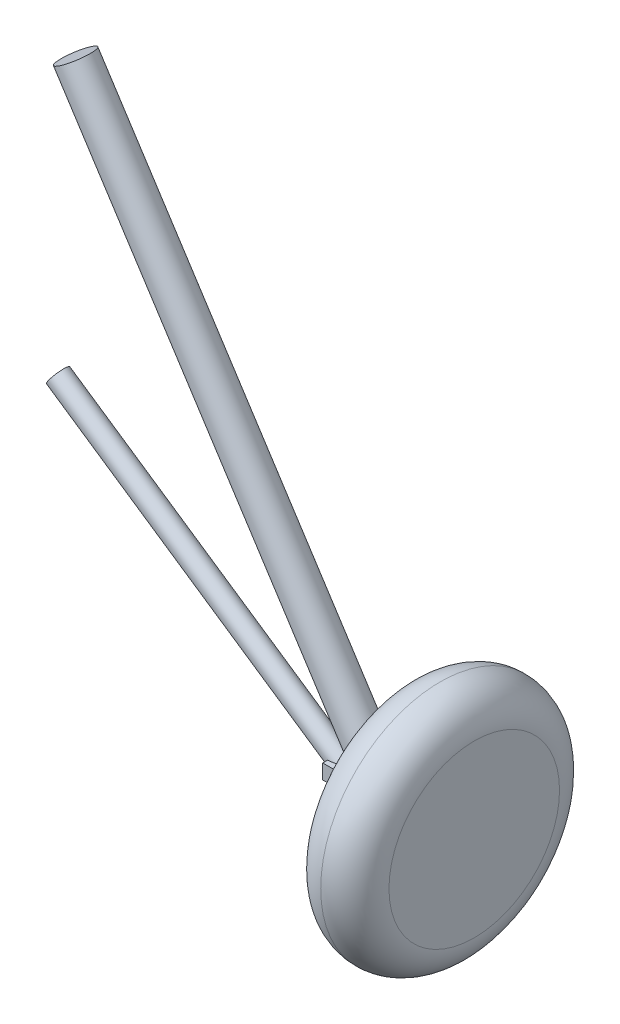
ISO-10303-21;
HEADER;
FILE_DESCRIPTION(('STEP AP214'),'2;1');
FILE_NAME('part.step','',(''),(''),'','','');
FILE_SCHEMA(('AUTOMOTIVE_DESIGN { 1 0 10303 214 1 1 1 1 }'));
ENDSEC;
DATA;
#1=APPLICATION_CONTEXT('core data for automotive mechanical design processes');
#2=APPLICATION_PROTOCOL_DEFINITION('international standard','automotive_design',2000,#1);
#3=PRODUCT_CONTEXT('',#1,'mechanical');
#4=PRODUCT('Part','Part','',(#3));
#5=PRODUCT_RELATED_PRODUCT_CATEGORY('part','',(#4));
#6=PRODUCT_DEFINITION_FORMATION('','',#4);
#7=PRODUCT_DEFINITION_CONTEXT('part definition',#1,'design');
#8=PRODUCT_DEFINITION('design','',#6,#7);
#9=PRODUCT_DEFINITION_SHAPE('','',#8);
#10=(LENGTH_UNIT() NAMED_UNIT(*) SI_UNIT(.MILLI.,.METRE.));
#11=(NAMED_UNIT(*) PLANE_ANGLE_UNIT() SI_UNIT($,.RADIAN.));
#12=(NAMED_UNIT(*) SI_UNIT($,.STERADIAN.) SOLID_ANGLE_UNIT());
#13=UNCERTAINTY_MEASURE_WITH_UNIT(LENGTH_MEASURE(1.E-05),#10,'distance_accuracy_value','');
#14=(GEOMETRIC_REPRESENTATION_CONTEXT(3) GLOBAL_UNCERTAINTY_ASSIGNED_CONTEXT((#13)) GLOBAL_UNIT_ASSIGNED_CONTEXT((#10,
#11,#12)) REPRESENTATION_CONTEXT('',''));
#15=CARTESIAN_POINT('',(0.,0.,0.));
#16=DIRECTION('',(0.,0.,1.));
#17=DIRECTION('',(1.,0.,0.));
#18=AXIS2_PLACEMENT_3D('',#15,#16,#17);
#19=CARTESIAN_POINT('',(-3.,0.162074381040965,-0.423194217162501));
#20=DIRECTION('',(0.,-1.,0.));
#21=DIRECTION('',(0.,0.,-1.));
#22=AXIS2_PLACEMENT_3D('',#19,#20,#21);
#23=PLANE('',#22);
#24=DIRECTION('',(0.,0.,-1.));
#25=VECTOR('',#24,1.);
#26=CARTESIAN_POINT('',(-2.70065203099796,0.162074381040965,-0.423194217162501));
#27=LINE('',#26,#25);
#28=CARTESIAN_POINT('',(-2.70065203099796,0.162074381040965,0.227293758419867));
#29=VERTEX_POINT('',#28);
#30=CARTESIAN_POINT('',(-2.70065203099796,0.162074381040965,-0.227293758419867));
#31=VERTEX_POINT('',#30);
#32=EDGE_CURVE('E11',#29,#31,#27,.T.);
#33=ORIENTED_EDGE('',*,*,#32,.F.);
#34=CARTESIAN_POINT('',(-3.04961610836401,0.162074381040965,0.));
#35=DIRECTION('',(0.,-1.,0.));
#36=DIRECTION('',(1.,0.,0.));
#37=AXIS2_PLACEMENT_3D('',#34,#35,#36);
#38=ELLIPSE('',#37,0.534674921679859,0.3);
#39=CARTESIAN_POINT('',(-3.,0.162074381040965,0.298705520991415));
#40=VERTEX_POINT('',#39);
#41=EDGE_CURVE('E131',#29,#40,#38,.T.);
#42=ORIENTED_EDGE('',*,*,#41,.T.);
#43=DIRECTION('',(0.,0.,-1.));
#44=VECTOR('',#43,1.);
#45=CARTESIAN_POINT('',(-3.,0.162074381040965,-0.423194217162501));
#46=LINE('',#45,#44);
#47=CARTESIAN_POINT('',(-3.,0.162074381040965,0.441202481722608));
#48=VERTEX_POINT('',#47);
#49=EDGE_CURVE('E121',#48,#40,#46,.T.);
#50=ORIENTED_EDGE('',*,*,#49,.F.);
#51=DIRECTION('',(1.,0.,0.));
#52=VECTOR('',#51,1.);
#53=CARTESIAN_POINT('',(-3.,0.162074381040965,0.441202481722608));
#54=LINE('',#53,#52);
#55=CARTESIAN_POINT('',(-1.99949547273326,0.162074381040965,0.441202481722608));
#56=VERTEX_POINT('',#55);
#57=EDGE_CURVE('E161',#48,#56,#54,.T.);
#58=ORIENTED_EDGE('',*,*,#57,.T.);
#59=CARTESIAN_POINT('',(-1.71943990638096,0.162074381040965,0.));
#60=DIRECTION('',(0.,-1.,0.));
#61=DIRECTION('',(1.,0.,0.));
#62=AXIS2_PLACEMENT_3D('',#59,#60,#61);
#63=ELLIPSE('',#62,0.595241474332954,0.500000000000001);
#64=CARTESIAN_POINT('',(-2.0364453186906,0.162074381040965,-0.423194217162501));
#65=VERTEX_POINT('',#64);
#66=EDGE_CURVE('E138',#56,#65,#63,.T.);
#67=ORIENTED_EDGE('',*,*,#66,.T.);
#68=DIRECTION('',(1.,0.,0.));
#69=VECTOR('',#68,1.);
#70=CARTESIAN_POINT('',(-3.,0.162074381040965,-0.423194217162501));
#71=LINE('',#70,#69);
#72=CARTESIAN_POINT('',(-3.,0.162074381040965,-0.423194217162501));
#73=VERTEX_POINT('',#72);
#74=EDGE_CURVE('E164',#73,#65,#71,.T.);
#75=ORIENTED_EDGE('',*,*,#74,.F.);
#76=CARTESIAN_POINT('',(-3.,0.162074381040965,-0.298705520991416));
#77=VERTEX_POINT('',#76);
#78=EDGE_CURVE('E129',#77,#73,#46,.T.);
#79=ORIENTED_EDGE('',*,*,#78,.F.);
#80=EDGE_CURVE('E50',#77,#31,#38,.T.);
#81=ORIENTED_EDGE('',*,*,#80,.T.);
#82=EDGE_LOOP('',(#33,#42,#50,#58,#67,#75,#79,#81));
#83=FACE_BOUND('',#82,.T.);
#84=ADVANCED_FACE('F35',(#83),#23,.F.);
#85=CARTESIAN_POINT('',(-1.,0.,0.));
#86=DIRECTION('',(1.,0.,0.));
#87=DIRECTION('',(0.,0.,-1.));
#88=AXIS2_PLACEMENT_3D('',#85,#86,#87);
#89=PLANE('',#88);
#90=CARTESIAN_POINT('',(-1.,0.,0.));
#91=DIRECTION('',(1.,0.,0.));
#92=DIRECTION('',(0.,0.,-1.));
#93=AXIS2_PLACEMENT_3D('',#90,#91,#92);
#94=CIRCLE('',#93,2.5);
#95=CARTESIAN_POINT('',(-1.,0.,-2.5));
#96=VERTEX_POINT('',#95);
#97=EDGE_CURVE('E146',#96,#96,#94,.F.);
#98=ORIENTED_EDGE('',*,*,#97,.T.);
#99=EDGE_LOOP('',(#98));
#100=FACE_BOUND('',#99,.T.);
#101=DIRECTION('',(0.,-1.,0.));
#102=VECTOR('',#101,1.);
#103=CARTESIAN_POINT('',(-1.,0.162074381040965,-0.423194217162501));
#104=LINE('',#103,#102);
#105=CARTESIAN_POINT('',(-1.,0.162074381040965,-0.423194217162501));
#106=VERTEX_POINT('',#105);
#107=CARTESIAN_POINT('',(-1.,-0.270123968401589,-0.423194217162501));
#108=VERTEX_POINT('',#107);
#109=EDGE_CURVE('E177',#106,#108,#104,.T.);
#110=ORIENTED_EDGE('',*,*,#109,.F.);
#111=DIRECTION('',(0.,0.,-1.));
#112=VECTOR('',#111,1.);
#113=CARTESIAN_POINT('',(-1.,0.162074381040965,-0.423194217162501));
#114=LINE('',#113,#112);
#115=CARTESIAN_POINT('',(-1.,0.162074381040965,0.441202481722608));
#116=VERTEX_POINT('',#115);
#117=EDGE_CURVE('E167',#116,#106,#114,.T.);
#118=ORIENTED_EDGE('',*,*,#117,.F.);
#119=DIRECTION('',(0.,1.,0.));
#120=VECTOR('',#119,1.);
#121=CARTESIAN_POINT('',(-1.,0.162074381040965,0.441202481722608));
#122=LINE('',#121,#120);
#123=CARTESIAN_POINT('',(-1.,-0.270123968401589,0.441202481722608));
#124=VERTEX_POINT('',#123);
#125=EDGE_CURVE('E171',#124,#116,#122,.T.);
#126=ORIENTED_EDGE('',*,*,#125,.F.);
#127=DIRECTION('',(0.,0.,1.));
#128=VECTOR('',#127,1.);
#129=CARTESIAN_POINT('',(-1.,-0.270123968401589,-0.423194217162501));
#130=LINE('',#129,#128);
#131=EDGE_CURVE('E174',#108,#124,#130,.T.);
#132=ORIENTED_EDGE('',*,*,#131,.F.);
#133=EDGE_LOOP('',(#110,#118,#126,#132));
#134=FACE_BOUND('',#133,.T.);
#135=ADVANCED_FACE('F228',(#100,#134),#89,.F.);
#136=CARTESIAN_POINT('',(0.,0.,0.));
#137=DIRECTION('',(1.,0.,0.));
#138=DIRECTION('',(0.,0.,-1.));
#139=AXIS2_PLACEMENT_3D('',#136,#137,#138);
#140=TOROIDAL_SURFACE('',#139,2.5,1.);
#141=CARTESIAN_POINT('',(0.,0.,0.));
#142=DIRECTION('',(1.,0.,0.));
#143=DIRECTION('',(0.,0.,-1.));
#144=AXIS2_PLACEMENT_3D('',#141,#142,#143);
#145=CIRCLE('',#144,3.5);
#146=CARTESIAN_POINT('',(0.,0.,-3.5));
#147=VERTEX_POINT('',#146);
#148=EDGE_CURVE('E149',#147,#147,#145,.F.);
#149=ORIENTED_EDGE('',*,*,#148,.T.);
#150=EDGE_LOOP('',(#149));
#151=FACE_BOUND('',#150,.T.);
#152=ORIENTED_EDGE('',*,*,#97,.F.);
#153=EDGE_LOOP('',(#152));
#154=FACE_BOUND('',#153,.T.);
#155=ADVANCED_FACE('F37',(#151,#154),#140,.T.);
#156=CARTESIAN_POINT('',(0.,0.,0.));
#157=DIRECTION('',(1.,0.,0.));
#158=DIRECTION('',(0.,0.,-1.));
#159=AXIS2_PLACEMENT_3D('',#156,#157,#158);
#160=TOROIDAL_SURFACE('',#159,2.5,1.);
#161=CARTESIAN_POINT('',(1.,0.,0.));
#162=DIRECTION('',(1.,0.,0.));
#163=DIRECTION('',(0.,0.,-1.));
#164=AXIS2_PLACEMENT_3D('',#161,#162,#163);
#165=CIRCLE('',#164,2.5);
#166=CARTESIAN_POINT('',(1.,0.,-2.5));
#167=VERTEX_POINT('',#166);
#168=EDGE_CURVE('E152',#167,#167,#165,.T.);
#169=ORIENTED_EDGE('',*,*,#168,.F.);
#170=EDGE_LOOP('',(#169));
#171=FACE_BOUND('',#170,.T.);
#172=ORIENTED_EDGE('',*,*,#148,.F.);
#173=EDGE_LOOP('',(#172));
#174=FACE_BOUND('',#173,.T.);
#175=ADVANCED_FACE('F318',(#171,#174),#160,.T.);
#176=CARTESIAN_POINT('',(1.,0.,0.));
#177=DIRECTION('',(1.,0.,0.));
#178=DIRECTION('',(0.,0.,-1.));
#179=AXIS2_PLACEMENT_3D('',#176,#177,#178);
#180=PLANE('',#179);
#181=ORIENTED_EDGE('',*,*,#168,.T.);
#182=EDGE_LOOP('',(#181));
#183=FACE_BOUND('',#182,.T.);
#184=ADVANCED_FACE('F314',(#183),#180,.T.);
#185=CARTESIAN_POINT('',(-3.,0.162074381040965,-0.423194217162501));
#186=DIRECTION('',(0.,0.,1.));
#187=DIRECTION('',(1.,0.,0.));
#188=AXIS2_PLACEMENT_3D('',#185,#186,#187);
#189=PLANE('',#188);
#190=ORIENTED_EDGE('',*,*,#74,.T.);
#191=DIRECTION('',(0.542593780966882,-0.839995231448407,0.));
#192=VECTOR('',#191,1.);
#193=CARTESIAN_POINT('',(-1.83842465902258,-0.144483518596219,-0.423194217162501));
#194=LINE('',#193,#192);
#195=CARTESIAN_POINT('',(-1.83842465902258,-0.144483518596218,-0.423194217162501));
#196=VERTEX_POINT('',#195);
#197=EDGE_CURVE('E187',#65,#196,#194,.T.);
#198=ORIENTED_EDGE('',*,*,#197,.T.);
#199=DIRECTION('',(-0.839995231448407,-0.542593780966882,0.));
#200=VECTOR('',#199,1.);
#201=CARTESIAN_POINT('',(-2.51830112297925,-0.583648798775908,-0.423194217162501));
#202=LINE('',#201,#200);
#203=CARTESIAN_POINT('',(-1.39107170032319,0.144483518596218,-0.423194217162501));
#204=VERTEX_POINT('',#203);
#205=EDGE_CURVE('E195',#204,#196,#202,.T.);
#206=ORIENTED_EDGE('',*,*,#205,.F.);
#207=DIRECTION('',(0.542593780966882,-0.839995231448407,0.));
#208=VECTOR('',#207,1.);
#209=CARTESIAN_POINT('',(-1.39107170032319,0.144483518596219,-0.423194217162501));
#210=LINE('',#209,#208);
#211=CARTESIAN_POINT('',(-1.40243449407132,0.162074381040965,-0.423194217162501));
#212=VERTEX_POINT('',#211);
#213=EDGE_CURVE('E193',#204,#212,#210,.F.);
#214=ORIENTED_EDGE('',*,*,#213,.T.);
#215=EDGE_CURVE('E128',#212,#106,#71,.T.);
#216=ORIENTED_EDGE('',*,*,#215,.T.);
#217=ORIENTED_EDGE('',*,*,#109,.T.);
#218=DIRECTION('',(1.,0.,0.));
#219=VECTOR('',#218,1.);
#220=CARTESIAN_POINT('',(-3.,-0.270123968401589,-0.423194217162501));
#221=LINE('',#220,#219);
#222=CARTESIAN_POINT('',(-3.,-0.270123968401589,-0.423194217162501));
#223=VERTEX_POINT('',#222);
#224=EDGE_CURVE('E155',#223,#108,#221,.T.);
#225=ORIENTED_EDGE('',*,*,#224,.F.);
#226=DIRECTION('',(0.,-1.,0.));
#227=VECTOR('',#226,1.);
#228=CARTESIAN_POINT('',(-3.,0.162074381040965,-0.423194217162501));
#229=LINE('',#228,#227);
#230=EDGE_CURVE('E170',#73,#223,#229,.T.);
#231=ORIENTED_EDGE('',*,*,#230,.F.);
#232=EDGE_LOOP('',(#190,#198,#206,#214,#216,#217,#225,#231));
#233=FACE_BOUND('',#232,.T.);
#234=ADVANCED_FACE('F298',(#233),#189,.F.);
#235=CARTESIAN_POINT('',(-3.,-0.270123968401589,-0.423194217162501));
#236=DIRECTION('',(0.,1.,0.));
#237=DIRECTION('',(0.,0.,1.));
#238=AXIS2_PLACEMENT_3D('',#235,#236,#237);
#239=PLANE('',#238);
#240=DIRECTION('',(0.,0.,1.));
#241=VECTOR('',#240,1.);
#242=CARTESIAN_POINT('',(-2.03292998218622,-0.270123968401589,-0.423194217162501));
#243=LINE('',#242,#241);
#244=CARTESIAN_POINT('',(-2.03292998218622,-0.270123968401589,-0.0464437481441615));
#245=VERTEX_POINT('',#244);
#246=CARTESIAN_POINT('',(-2.03292998218622,-0.270123968401589,0.0464437481441615));
#247=VERTEX_POINT('',#246);
#248=EDGE_CURVE('E198',#245,#247,#243,.T.);
#249=ORIENTED_EDGE('',*,*,#248,.F.);
#250=CARTESIAN_POINT('',(-1.44026196849277,-0.270123968401589,0.));
#251=DIRECTION('',(0.,1.,0.));
#252=DIRECTION('',(1.,0.,0.));
#253=AXIS2_PLACEMENT_3D('',#250,#251,#252);
#254=ELLIPSE('',#253,0.595241474332954,0.500000000000001);
#255=EDGE_CURVE('E179',#245,#247,#254,.T.);
#256=ORIENTED_EDGE('',*,*,#255,.T.);
#257=EDGE_LOOP('',(#249,#256));
#258=FACE_BOUND('',#257,.T.);
#259=ORIENTED_EDGE('',*,*,#131,.T.);
#260=DIRECTION('',(1.,0.,0.));
#261=VECTOR('',#260,1.);
#262=CARTESIAN_POINT('',(-3.,-0.270123968401589,0.441202481722608));
#263=LINE('',#262,#261);
#264=CARTESIAN_POINT('',(-3.,-0.270123968401589,0.441202481722608));
#265=VERTEX_POINT('',#264);
#266=EDGE_CURVE('E158',#265,#124,#263,.T.);
#267=ORIENTED_EDGE('',*,*,#266,.F.);
#268=DIRECTION('',(0.,0.,1.));
#269=VECTOR('',#268,1.);
#270=CARTESIAN_POINT('',(-3.,-0.270123968401589,-0.423194217162501));
#271=LINE('',#270,#269);
#272=EDGE_CURVE('E182',#223,#265,#271,.T.);
#273=ORIENTED_EDGE('',*,*,#272,.F.);
#274=ORIENTED_EDGE('',*,*,#224,.T.);
#275=EDGE_LOOP('',(#259,#267,#273,#274));
#276=FACE_BOUND('',#275,.T.);
#277=ADVANCED_FACE('F246',(#258,#276),#239,.F.);
#278=CARTESIAN_POINT('',(-3.,0.162074381040965,0.441202481722608));
#279=DIRECTION('',(0.,0.,-1.));
#280=DIRECTION('',(-1.,0.,0.));
#281=AXIS2_PLACEMENT_3D('',#278,#279,#280);
#282=PLANE('',#281);
#283=CARTESIAN_POINT('',(-1.43938434002866,0.162074381040965,0.441202481722608));
#284=VERTEX_POINT('',#283);
#285=EDGE_CURVE('E163',#284,#116,#54,.T.);
#286=ORIENTED_EDGE('',*,*,#285,.F.);
#287=DIRECTION('',(0.542593780966882,-0.839995231448407,0.));
#288=VECTOR('',#287,1.);
#289=CARTESIAN_POINT('',(-1.41714321562016,0.127642658635474,0.441202481722608));
#290=LINE('',#289,#288);
#291=CARTESIAN_POINT('',(-1.41714321562016,0.127642658635473,0.441202481722608));
#292=VERTEX_POINT('',#291);
#293=EDGE_CURVE('E191',#284,#292,#290,.T.);
#294=ORIENTED_EDGE('',*,*,#293,.T.);
#295=DIRECTION('',(0.839995231448407,0.542593780966882,0.));
#296=VECTOR('',#295,1.);
#297=CARTESIAN_POINT('',(-2.51830112297925,-0.583648798775908,0.441202481722608));
#298=LINE('',#297,#296);
#299=CARTESIAN_POINT('',(-1.81235314372561,-0.127642658635473,0.441202481722608));
#300=VERTEX_POINT('',#299);
#301=EDGE_CURVE('E201',#300,#292,#298,.T.);
#302=ORIENTED_EDGE('',*,*,#301,.F.);
#303=DIRECTION('',(0.542593780966882,-0.839995231448407,0.));
#304=VECTOR('',#303,1.);
#305=CARTESIAN_POINT('',(-1.81235314372562,-0.127642658635474,0.441202481722608));
#306=LINE('',#305,#304);
#307=EDGE_CURVE('E189',#300,#56,#306,.F.);
#308=ORIENTED_EDGE('',*,*,#307,.T.);
#309=ORIENTED_EDGE('',*,*,#57,.F.);
#310=DIRECTION('',(0.,1.,0.));
#311=VECTOR('',#310,1.);
#312=CARTESIAN_POINT('',(-3.,0.162074381040965,0.441202481722608));
#313=LINE('',#312,#311);
#314=EDGE_CURVE('E125',#265,#48,#313,.T.);
#315=ORIENTED_EDGE('',*,*,#314,.F.);
#316=ORIENTED_EDGE('',*,*,#266,.T.);
#317=ORIENTED_EDGE('',*,*,#125,.T.);
#318=EDGE_LOOP('',(#286,#294,#302,#308,#309,#315,#316,#317));
#319=FACE_BOUND('',#318,.T.);
#320=ADVANCED_FACE('F239',(#319),#282,.F.);
#321=DIRECTION('',(0.,0.,-1.));
#322=VECTOR('',#321,1.);
#323=CARTESIAN_POINT('',(-1.36383909816487,0.162074381040965,-0.423194217162501));
#324=LINE('',#323,#322);
#325=CARTESIAN_POINT('',(-1.36383909816487,0.162074381040965,0.400969484907506));
#326=VERTEX_POINT('',#325);
#327=CARTESIAN_POINT('',(-1.36383909816487,0.162074381040965,-0.400969484907506));
#328=VERTEX_POINT('',#327);
#329=EDGE_CURVE('E143',#326,#328,#324,.T.);
#330=ORIENTED_EDGE('',*,*,#329,.F.);
#331=EDGE_CURVE('E139',#326,#284,#63,.T.);
#332=ORIENTED_EDGE('',*,*,#331,.T.);
#333=ORIENTED_EDGE('',*,*,#285,.T.);
#334=ORIENTED_EDGE('',*,*,#117,.T.);
#335=ORIENTED_EDGE('',*,*,#215,.F.);
#336=EDGE_CURVE('E141',#212,#328,#63,.T.);
#337=ORIENTED_EDGE('',*,*,#336,.T.);
#338=EDGE_LOOP('',(#330,#332,#333,#334,#335,#337));
#339=FACE_BOUND('',#338,.T.);
#340=ADVANCED_FACE('F230',(#339),#23,.F.);
#341=CARTESIAN_POINT('',(-3.,0.,0.));
#342=DIRECTION('',(-1.,0.,0.));
#343=DIRECTION('',(0.,0.,1.));
#344=AXIS2_PLACEMENT_3D('',#341,#342,#343);
#345=PLANE('',#344);
#346=CARTESIAN_POINT('',(-3.,0.128442440324657,0.));
#347=DIRECTION('',(-1.,0.,0.));
#348=DIRECTION('',(0.,-1.,0.));
#349=AXIS2_PLACEMENT_3D('',#346,#347,#348);
#350=ELLIPSE('',#349,0.362425749647852,0.3);
#351=EDGE_CURVE('E43',#77,#40,#350,.T.);
#352=ORIENTED_EDGE('',*,*,#351,.F.);
#353=ORIENTED_EDGE('',*,*,#78,.T.);
#354=ORIENTED_EDGE('',*,*,#230,.T.);
#355=ORIENTED_EDGE('',*,*,#272,.T.);
#356=ORIENTED_EDGE('',*,*,#314,.T.);
#357=ORIENTED_EDGE('',*,*,#49,.T.);
#358=EDGE_LOOP('',(#352,#353,#354,#355,#356,#357));
#359=FACE_BOUND('',#358,.T.);
#360=ADVANCED_FACE('F122',(#359),#345,.T.);
#361=CARTESIAN_POINT('',(-10.6853288887416,14.0422629402579,0.));
#362=DIRECTION('',(0.542593780966882,-0.839995231448407,0.));
#363=DIRECTION('',(0.839995231448407,0.542593780966882,0.));
#364=AXIS2_PLACEMENT_3D('',#361,#362,#363);
#365=PLANE('',#364);
#366=CARTESIAN_POINT('',(-10.6853288887416,14.0422629402579,0.));
#367=DIRECTION('',(0.542593780966882,-0.839995231448407,0.));
#368=DIRECTION('',(0.839995231448407,0.542593780966882,0.));
#369=AXIS2_PLACEMENT_3D('',#366,#367,#368);
#370=CIRCLE('',#369,0.500000000000002);
#371=CARTESIAN_POINT('',(-10.2653312730174,14.3135598307413,0.));
#372=VERTEX_POINT('',#371);
#373=EDGE_CURVE('E135',#372,#372,#370,.T.);
#374=ORIENTED_EDGE('',*,*,#373,.F.);
#375=EDGE_LOOP('',(#374));
#376=FACE_BOUND('',#375,.T.);
#377=ADVANCED_FACE('F245',(#376),#365,.F.);
#378=CARTESIAN_POINT('',(-1.19475056394868,0.271296890483441,0.));
#379=DIRECTION('',(-0.542593780966882,0.839995231448407,0.));
#380=DIRECTION('',(-0.839995231448407,-0.542593780966882,0.));
#381=AXIS2_PLACEMENT_3D('',#378,#379,#380);
#382=PLANE('',#381);
#383=CARTESIAN_POINT('',(-1.61474817967289,0.,0.));
#384=DIRECTION('',(0.542593780966882,-0.839995231448407,0.));
#385=DIRECTION('',(0.839995231448407,0.542593780966882,0.));
#386=AXIS2_PLACEMENT_3D('',#383,#384,#385);
#387=CIRCLE('',#386,0.5);
#388=EDGE_CURVE('E205',#328,#326,#387,.T.);
#389=ORIENTED_EDGE('',*,*,#388,.T.);
#390=ORIENTED_EDGE('',*,*,#329,.T.);
#391=EDGE_LOOP('',(#389,#390));
#392=FACE_BOUND('',#391,.T.);
#393=ADVANCED_FACE('F259',(#392),#382,.F.);
#394=EDGE_CURVE('E204',#292,#300,#387,.T.);
#395=ORIENTED_EDGE('',*,*,#394,.T.);
#396=ORIENTED_EDGE('',*,*,#301,.T.);
#397=EDGE_LOOP('',(#395,#396));
#398=FACE_BOUND('',#397,.T.);
#399=ADVANCED_FACE('F261',(#398),#382,.F.);
#400=EDGE_CURVE('E208',#196,#204,#387,.T.);
#401=ORIENTED_EDGE('',*,*,#400,.T.);
#402=ORIENTED_EDGE('',*,*,#205,.T.);
#403=EDGE_LOOP('',(#401,#402));
#404=FACE_BOUND('',#403,.T.);
#405=ADVANCED_FACE('F263',(#404),#382,.F.);
#406=CARTESIAN_POINT('',(-1.61474817967289,0.,0.));
#407=DIRECTION('',(0.542593780966882,-0.839995231448407,0.));
#408=DIRECTION('',(0.839995231448407,0.542593780966882,0.));
#409=AXIS2_PLACEMENT_3D('',#406,#407,#408);
#410=CYLINDRICAL_SURFACE('',#409,0.500000000000001);
#411=ORIENTED_EDGE('',*,*,#373,.T.);
#412=EDGE_LOOP('',(#411));
#413=FACE_BOUND('',#412,.T.);
#414=ORIENTED_EDGE('',*,*,#197,.F.);
#415=ORIENTED_EDGE('',*,*,#66,.F.);
#416=ORIENTED_EDGE('',*,*,#307,.F.);
#417=ORIENTED_EDGE('',*,*,#394,.F.);
#418=ORIENTED_EDGE('',*,*,#293,.F.);
#419=ORIENTED_EDGE('',*,*,#331,.F.);
#420=ORIENTED_EDGE('',*,*,#388,.F.);
#421=ORIENTED_EDGE('',*,*,#336,.F.);
#422=ORIENTED_EDGE('',*,*,#213,.F.);
#423=ORIENTED_EDGE('',*,*,#400,.F.);
#424=EDGE_LOOP('',(#414,#415,#416,#417,#418,#419,#420,#421,#422,#423));
#425=FACE_BOUND('',#424,.T.);
#426=ADVANCED_FACE('F257',(#413,#425),#410,.T.);
#427=ORIENTED_EDGE('',*,*,#255,.F.);
#428=EDGE_CURVE('E291',#247,#245,#387,.T.);
#429=ORIENTED_EDGE('',*,*,#428,.F.);
#430=EDGE_LOOP('',(#427,#429));
#431=FACE_BOUND('',#430,.T.);
#432=ADVANCED_FACE('F278',(#431),#410,.T.);
#433=ORIENTED_EDGE('',*,*,#428,.T.);
#434=ORIENTED_EDGE('',*,*,#248,.T.);
#435=EDGE_LOOP('',(#433,#434));
#436=FACE_BOUND('',#435,.T.);
#437=ADVANCED_FACE('F269',(#436),#382,.F.);
#438=CARTESIAN_POINT('',(-2.64218646681122,0.248326726474175,0.));
#439=DIRECTION('',(-0.827755754913916,0.561088593901973,0.));
#440=DIRECTION('',(-0.561088593901973,-0.827755754913916,0.));
#441=AXIS2_PLACEMENT_3D('',#438,#439,#440);
#442=PLANE('',#441);
#443=CARTESIAN_POINT('',(-2.81051304498181,0.,0.));
#444=DIRECTION('',(0.827755754913916,-0.561088593901973,0.));
#445=DIRECTION('',(0.561088593901973,0.827755754913916,0.));
#446=AXIS2_PLACEMENT_3D('',#443,#444,#445);
#447=CIRCLE('',#446,0.3);
#448=EDGE_CURVE('E211',#31,#29,#447,.T.);
#449=ORIENTED_EDGE('',*,*,#448,.T.);
#450=ORIENTED_EDGE('',*,*,#32,.T.);
#451=EDGE_LOOP('',(#449,#450));
#452=FACE_BOUND('',#451,.T.);
#453=ADVANCED_FACE('F224',(#452),#442,.F.);
#454=CARTESIAN_POINT('',(-2.81051304498181,0.,0.));
#455=DIRECTION('',(0.827755754913916,-0.561088593901973,0.));
#456=DIRECTION('',(0.561088593901973,0.827755754913916,0.));
#457=AXIS2_PLACEMENT_3D('',#454,#455,#456);
#458=CYLINDRICAL_SURFACE('',#457,0.3);
#459=CARTESIAN_POINT('',(-11.1994118550771,5.68635785350935,0.));
#460=DIRECTION('',(0.827755754913916,-0.561088593901973,0.));
#461=DIRECTION('',(0.561088593901973,0.827755754913916,0.));
#462=AXIS2_PLACEMENT_3D('',#459,#460,#461);
#463=CIRCLE('',#462,0.299999999999999);
#464=CARTESIAN_POINT('',(-11.0310852769065,5.93468457998353,0.));
#465=VERTEX_POINT('',#464);
#466=EDGE_CURVE('E213',#465,#465,#463,.T.);
#467=ORIENTED_EDGE('',*,*,#466,.T.);
#468=EDGE_LOOP('',(#467));
#469=FACE_BOUND('',#468,.T.);
#470=ORIENTED_EDGE('',*,*,#41,.F.);
#471=ORIENTED_EDGE('',*,*,#448,.F.);
#472=ORIENTED_EDGE('',*,*,#80,.F.);
#473=ORIENTED_EDGE('',*,*,#351,.T.);
#474=EDGE_LOOP('',(#470,#471,#472,#473));
#475=FACE_BOUND('',#474,.T.);
#476=ADVANCED_FACE('F137',(#469,#475),#458,.T.);
#477=CARTESIAN_POINT('',(-11.1994118550771,5.68635785350935,0.));
#478=DIRECTION('',(0.827755754913916,-0.561088593901973,0.));
#479=DIRECTION('',(0.561088593901973,0.827755754913916,0.));
#480=AXIS2_PLACEMENT_3D('',#477,#478,#479);
#481=PLANE('',#480);
#482=ORIENTED_EDGE('',*,*,#466,.F.);
#483=EDGE_LOOP('',(#482));
#484=FACE_BOUND('',#483,.T.);
#485=ADVANCED_FACE('F218',(#484),#481,.F.);
#486=CLOSED_SHELL('',(#84,#135,#155,#175,#184,#234,#277,#320,#340,#360,#377,#393,#399,#405,#426,
#432,#437,#453,#476,#485));
#487=MANIFOLD_SOLID_BREP('B2',#486);
#488=ADVANCED_BREP_SHAPE_REPRESENTATION('',(#18,#487),#14);
#489=SHAPE_DEFINITION_REPRESENTATION(#9,#488);
ENDSEC;
END-ISO-10303-21;
